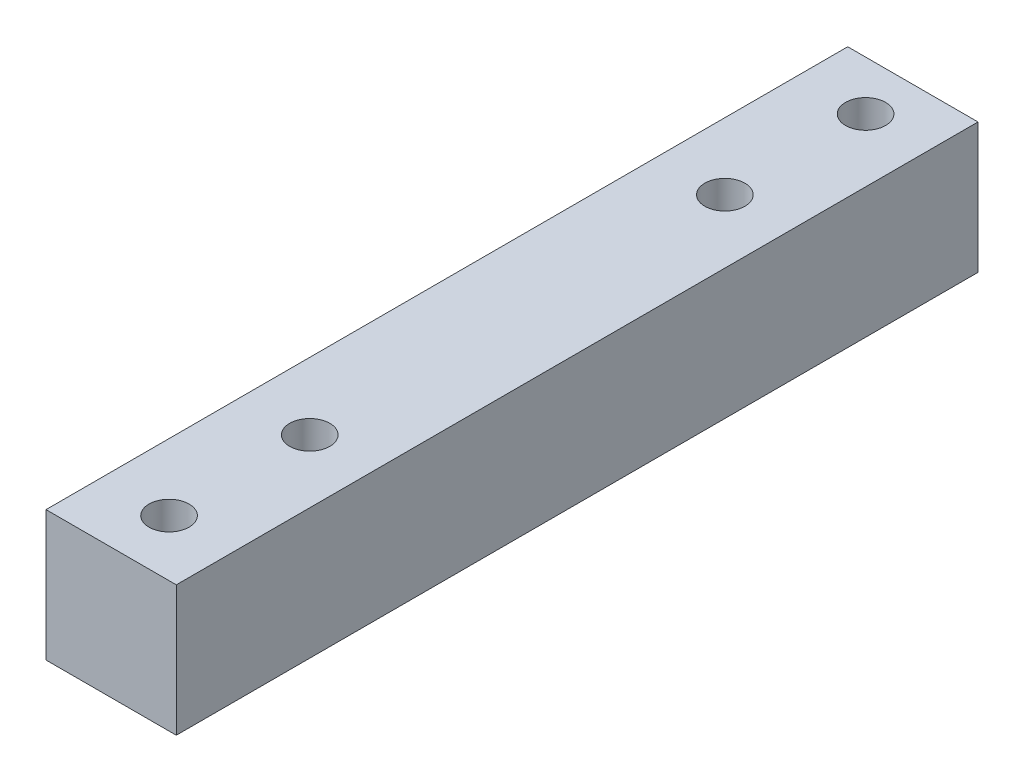
ISO-10303-21;
HEADER;
FILE_DESCRIPTION(('STEP AP214'),'2;1');
FILE_NAME('part.step','',(''),(''),'','','');
FILE_SCHEMA(('AUTOMOTIVE_DESIGN { 1 0 10303 214 1 1 1 1 }'));
ENDSEC;
DATA;
#1=APPLICATION_CONTEXT('core data for automotive mechanical design processes');
#2=APPLICATION_PROTOCOL_DEFINITION('international standard','automotive_design',2000,#1);
#3=PRODUCT_CONTEXT('',#1,'mechanical');
#4=PRODUCT('Part','Part','',(#3));
#5=PRODUCT_RELATED_PRODUCT_CATEGORY('part','',(#4));
#6=PRODUCT_DEFINITION_FORMATION('','',#4);
#7=PRODUCT_DEFINITION_CONTEXT('part definition',#1,'design');
#8=PRODUCT_DEFINITION('design','',#6,#7);
#9=PRODUCT_DEFINITION_SHAPE('','',#8);
#10=(LENGTH_UNIT() NAMED_UNIT(*) SI_UNIT(.MILLI.,.METRE.));
#11=(NAMED_UNIT(*) PLANE_ANGLE_UNIT() SI_UNIT($,.RADIAN.));
#12=(NAMED_UNIT(*) SI_UNIT($,.STERADIAN.) SOLID_ANGLE_UNIT());
#13=UNCERTAINTY_MEASURE_WITH_UNIT(LENGTH_MEASURE(1.E-05),#10,'distance_accuracy_value','');
#14=(GEOMETRIC_REPRESENTATION_CONTEXT(3) GLOBAL_UNCERTAINTY_ASSIGNED_CONTEXT((#13)) GLOBAL_UNIT_ASSIGNED_CONTEXT((#10,
#11,#12)) REPRESENTATION_CONTEXT('',''));
#15=CARTESIAN_POINT('',(0.,0.,0.));
#16=DIRECTION('',(0.,0.,1.));
#17=DIRECTION('',(1.,0.,0.));
#18=AXIS2_PLACEMENT_3D('',#15,#16,#17);
#19=CARTESIAN_POINT('',(6.5,6.80952380952381,80.));
#20=DIRECTION('',(-1.,0.,0.));
#21=DIRECTION('',(0.,-1.,0.));
#22=AXIS2_PLACEMENT_3D('',#19,#20,#21);
#23=PLANE('',#22);
#24=DIRECTION('',(0.,1.,0.));
#25=VECTOR('',#24,1.);
#26=CARTESIAN_POINT('',(6.5,6.80952380952381,0.));
#27=LINE('',#26,#25);
#28=CARTESIAN_POINT('',(6.5,-6.19047619047619,0.));
#29=VERTEX_POINT('',#28);
#30=CARTESIAN_POINT('',(6.5,6.80952380952381,0.));
#31=VERTEX_POINT('',#30);
#32=EDGE_CURVE('E110',#29,#31,#27,.T.);
#33=ORIENTED_EDGE('',*,*,#32,.T.);
#34=DIRECTION('',(0.,0.,-1.));
#35=VECTOR('',#34,1.);
#36=CARTESIAN_POINT('',(6.5,6.80952380952381,80.));
#37=LINE('',#36,#35);
#38=CARTESIAN_POINT('',(6.5,6.80952380952381,80.));
#39=VERTEX_POINT('',#38);
#40=EDGE_CURVE('E11',#39,#31,#37,.T.);
#41=ORIENTED_EDGE('',*,*,#40,.F.);
#42=DIRECTION('',(0.,1.,0.));
#43=VECTOR('',#42,1.);
#44=CARTESIAN_POINT('',(6.5,6.80952380952381,80.));
#45=LINE('',#44,#43);
#46=CARTESIAN_POINT('',(6.5,-6.19047619047619,80.));
#47=VERTEX_POINT('',#46);
#48=EDGE_CURVE('E93',#47,#39,#45,.T.);
#49=ORIENTED_EDGE('',*,*,#48,.F.);
#50=DIRECTION('',(0.,0.,-1.));
#51=VECTOR('',#50,1.);
#52=CARTESIAN_POINT('',(6.5,-6.19047619047619,80.));
#53=LINE('',#52,#51);
#54=EDGE_CURVE('E106',#47,#29,#53,.T.);
#55=ORIENTED_EDGE('',*,*,#54,.T.);
#56=EDGE_LOOP('',(#33,#41,#49,#55));
#57=FACE_BOUND('',#56,.T.);
#58=ADVANCED_FACE('F39',(#57),#23,.F.);
#59=CARTESIAN_POINT('',(-6.5,6.80952380952381,80.));
#60=DIRECTION('',(0.,-1.,0.));
#61=DIRECTION('',(0.,0.,-1.));
#62=AXIS2_PLACEMENT_3D('',#59,#60,#61);
#63=PLANE('',#62);
#64=CARTESIAN_POINT('',(0.197793720815714,6.80952380952381,4.91688549742749));
#65=DIRECTION('',(0.,1.,0.));
#66=DIRECTION('',(0.,0.,1.));
#67=AXIS2_PLACEMENT_3D('',#64,#65,#66);
#68=CIRCLE('',#67,2.);
#69=CARTESIAN_POINT('',(0.197793720815714,6.80952380952381,6.91688549742749));
#70=VERTEX_POINT('',#69);
#71=EDGE_CURVE('E129',#70,#70,#68,.T.);
#72=ORIENTED_EDGE('',*,*,#71,.F.);
#73=EDGE_LOOP('',(#72));
#74=FACE_BOUND('',#73,.T.);
#75=CARTESIAN_POINT('',(0.157458730872985,6.80952380952381,18.9168854974275));
#76=DIRECTION('',(0.,1.,0.));
#77=DIRECTION('',(0.,0.,1.));
#78=AXIS2_PLACEMENT_3D('',#75,#76,#77);
#79=CIRCLE('',#78,2.);
#80=CARTESIAN_POINT('',(0.157458730872985,6.80952380952381,20.9168854974275));
#81=VERTEX_POINT('',#80);
#82=EDGE_CURVE('E246',#81,#81,#79,.T.);
#83=ORIENTED_EDGE('',*,*,#82,.F.);
#84=EDGE_LOOP('',(#83));
#85=FACE_BOUND('',#84,.T.);
#86=CARTESIAN_POINT('',(0.197793720815714,6.80952380952381,60.3793139694021));
#87=DIRECTION('',(0.,1.,0.));
#88=DIRECTION('',(0.,0.,1.));
#89=AXIS2_PLACEMENT_3D('',#86,#87,#88);
#90=CIRCLE('',#89,2.);
#91=CARTESIAN_POINT('',(0.197793720815714,6.80952380952381,62.3793139694021));
#92=VERTEX_POINT('',#91);
#93=EDGE_CURVE('E238',#92,#92,#90,.T.);
#94=ORIENTED_EDGE('',*,*,#93,.F.);
#95=EDGE_LOOP('',(#94));
#96=FACE_BOUND('',#95,.T.);
#97=CARTESIAN_POINT('',(0.157458730872985,6.80952380952381,74.3793139694021));
#98=DIRECTION('',(0.,1.,0.));
#99=DIRECTION('',(0.,0.,1.));
#100=AXIS2_PLACEMENT_3D('',#97,#98,#99);
#101=CIRCLE('',#100,2.);
#102=CARTESIAN_POINT('',(0.157458730872985,6.80952380952381,76.3793139694021));
#103=VERTEX_POINT('',#102);
#104=EDGE_CURVE('E247',#103,#103,#101,.T.);
#105=ORIENTED_EDGE('',*,*,#104,.F.);
#106=EDGE_LOOP('',(#105));
#107=FACE_BOUND('',#106,.T.);
#108=DIRECTION('',(-1.,0.,0.));
#109=VECTOR('',#108,1.);
#110=CARTESIAN_POINT('',(-6.5,6.80952380952381,0.));
#111=LINE('',#110,#109);
#112=CARTESIAN_POINT('',(-6.5,6.80952380952381,0.));
#113=VERTEX_POINT('',#112);
#114=EDGE_CURVE('E98',#31,#113,#111,.T.);
#115=ORIENTED_EDGE('',*,*,#114,.T.);
#116=DIRECTION('',(0.,0.,-1.));
#117=VECTOR('',#116,1.);
#118=CARTESIAN_POINT('',(-6.5,6.80952380952381,80.));
#119=LINE('',#118,#117);
#120=CARTESIAN_POINT('',(-6.5,6.80952380952381,80.));
#121=VERTEX_POINT('',#120);
#122=EDGE_CURVE('E49',#121,#113,#119,.T.);
#123=ORIENTED_EDGE('',*,*,#122,.F.);
#124=DIRECTION('',(-1.,0.,0.));
#125=VECTOR('',#124,1.);
#126=CARTESIAN_POINT('',(-6.5,6.80952380952381,80.));
#127=LINE('',#126,#125);
#128=EDGE_CURVE('E88',#39,#121,#127,.T.);
#129=ORIENTED_EDGE('',*,*,#128,.F.);
#130=ORIENTED_EDGE('',*,*,#40,.T.);
#131=EDGE_LOOP('',(#115,#123,#129,#130));
#132=FACE_BOUND('',#131,.T.);
#133=ADVANCED_FACE('F97',(#74,#85,#96,#107,#132),#63,.F.);
#134=CARTESIAN_POINT('',(-6.5,6.80952380952381,80.));
#135=DIRECTION('',(1.,0.,0.));
#136=DIRECTION('',(0.,0.,-1.));
#137=AXIS2_PLACEMENT_3D('',#134,#135,#136);
#138=PLANE('',#137);
#139=DIRECTION('',(0.,-1.,0.));
#140=VECTOR('',#139,1.);
#141=CARTESIAN_POINT('',(-6.5,6.80952380952381,0.));
#142=LINE('',#141,#140);
#143=CARTESIAN_POINT('',(-6.5,-6.19047619047619,0.));
#144=VERTEX_POINT('',#143);
#145=EDGE_CURVE('E75',#113,#144,#142,.T.);
#146=ORIENTED_EDGE('',*,*,#145,.T.);
#147=DIRECTION('',(0.,0.,-1.));
#148=VECTOR('',#147,1.);
#149=CARTESIAN_POINT('',(-6.5,-6.19047619047619,80.));
#150=LINE('',#149,#148);
#151=CARTESIAN_POINT('',(-6.5,-6.19047619047619,80.));
#152=VERTEX_POINT('',#151);
#153=EDGE_CURVE('E100',#152,#144,#150,.T.);
#154=ORIENTED_EDGE('',*,*,#153,.F.);
#155=DIRECTION('',(0.,-1.,0.));
#156=VECTOR('',#155,1.);
#157=CARTESIAN_POINT('',(-6.5,6.80952380952381,80.));
#158=LINE('',#157,#156);
#159=EDGE_CURVE('E91',#121,#152,#158,.T.);
#160=ORIENTED_EDGE('',*,*,#159,.F.);
#161=ORIENTED_EDGE('',*,*,#122,.T.);
#162=EDGE_LOOP('',(#146,#154,#160,#161));
#163=FACE_BOUND('',#162,.T.);
#164=ADVANCED_FACE('F102',(#163),#138,.F.);
#165=CARTESIAN_POINT('',(-6.5,-6.19047619047619,80.));
#166=DIRECTION('',(0.,1.,0.));
#167=DIRECTION('',(-1.,0.,0.));
#168=AXIS2_PLACEMENT_3D('',#165,#166,#167);
#169=PLANE('',#168);
#170=CARTESIAN_POINT('',(0.197793720815714,-6.19047619047619,4.91688549742749));
#171=DIRECTION('',(0.,1.,0.));
#172=DIRECTION('',(-1.,0.,0.));
#173=AXIS2_PLACEMENT_3D('',#170,#171,#172);
#174=CIRCLE('',#173,2.);
#175=CARTESIAN_POINT('',(-1.80220627918429,-6.19047619047619,4.91688549742749));
#176=VERTEX_POINT('',#175);
#177=EDGE_CURVE('E42',#176,#176,#174,.T.);
#178=ORIENTED_EDGE('',*,*,#177,.T.);
#179=EDGE_LOOP('',(#178));
#180=FACE_BOUND('',#179,.T.);
#181=CARTESIAN_POINT('',(0.157458730872985,-6.19047619047619,18.9168854974275));
#182=DIRECTION('',(0.,1.,0.));
#183=DIRECTION('',(-1.,0.,0.));
#184=AXIS2_PLACEMENT_3D('',#181,#182,#183);
#185=CIRCLE('',#184,2.);
#186=CARTESIAN_POINT('',(-1.84254126912702,-6.19047619047619,18.9168854974275));
#187=VERTEX_POINT('',#186);
#188=EDGE_CURVE('E132',#187,#187,#185,.T.);
#189=ORIENTED_EDGE('',*,*,#188,.T.);
#190=EDGE_LOOP('',(#189));
#191=FACE_BOUND('',#190,.T.);
#192=CARTESIAN_POINT('',(0.197793720815714,-6.19047619047619,60.3793139694021));
#193=DIRECTION('',(0.,1.,0.));
#194=DIRECTION('',(-1.,0.,0.));
#195=AXIS2_PLACEMENT_3D('',#192,#193,#194);
#196=CIRCLE('',#195,2.);
#197=CARTESIAN_POINT('',(-1.80220627918429,-6.19047619047619,60.3793139694021));
#198=VERTEX_POINT('',#197);
#199=EDGE_CURVE('E128',#198,#198,#196,.T.);
#200=ORIENTED_EDGE('',*,*,#199,.T.);
#201=EDGE_LOOP('',(#200));
#202=FACE_BOUND('',#201,.T.);
#203=CARTESIAN_POINT('',(0.157458730872985,-6.19047619047619,74.3793139694021));
#204=DIRECTION('',(0.,1.,0.));
#205=DIRECTION('',(-1.,0.,0.));
#206=AXIS2_PLACEMENT_3D('',#203,#204,#205);
#207=CIRCLE('',#206,2.);
#208=CARTESIAN_POINT('',(-1.84254126912702,-6.19047619047619,74.3793139694021));
#209=VERTEX_POINT('',#208);
#210=EDGE_CURVE('E124',#209,#209,#207,.T.);
#211=ORIENTED_EDGE('',*,*,#210,.T.);
#212=EDGE_LOOP('',(#211));
#213=FACE_BOUND('',#212,.T.);
#214=DIRECTION('',(1.,0.,0.));
#215=VECTOR('',#214,1.);
#216=CARTESIAN_POINT('',(-6.5,-6.19047619047619,0.));
#217=LINE('',#216,#215);
#218=EDGE_CURVE('E81',#144,#29,#217,.T.);
#219=ORIENTED_EDGE('',*,*,#218,.T.);
#220=ORIENTED_EDGE('',*,*,#54,.F.);
#221=DIRECTION('',(1.,0.,0.));
#222=VECTOR('',#221,1.);
#223=CARTESIAN_POINT('',(-6.5,-6.19047619047619,80.));
#224=LINE('',#223,#222);
#225=EDGE_CURVE('E58',#152,#47,#224,.T.);
#226=ORIENTED_EDGE('',*,*,#225,.F.);
#227=ORIENTED_EDGE('',*,*,#153,.T.);
#228=EDGE_LOOP('',(#219,#220,#226,#227));
#229=FACE_BOUND('',#228,.T.);
#230=ADVANCED_FACE('F141',(#180,#191,#202,#213,#229),#169,.F.);
#231=CARTESIAN_POINT('',(0.,0.,80.));
#232=DIRECTION('',(0.,0.,1.));
#233=DIRECTION('',(1.,0.,0.));
#234=AXIS2_PLACEMENT_3D('',#231,#232,#233);
#235=PLANE('',#234);
#236=ORIENTED_EDGE('',*,*,#48,.T.);
#237=ORIENTED_EDGE('',*,*,#128,.T.);
#238=ORIENTED_EDGE('',*,*,#159,.T.);
#239=ORIENTED_EDGE('',*,*,#225,.T.);
#240=EDGE_LOOP('',(#236,#237,#238,#239));
#241=FACE_BOUND('',#240,.T.);
#242=ADVANCED_FACE('F89',(#241),#235,.T.);
#243=CARTESIAN_POINT('',(0.,0.,0.));
#244=DIRECTION('',(0.,0.,1.));
#245=DIRECTION('',(1.,0.,0.));
#246=AXIS2_PLACEMENT_3D('',#243,#244,#245);
#247=PLANE('',#246);
#248=ORIENTED_EDGE('',*,*,#32,.F.);
#249=ORIENTED_EDGE('',*,*,#218,.F.);
#250=ORIENTED_EDGE('',*,*,#145,.F.);
#251=ORIENTED_EDGE('',*,*,#114,.F.);
#252=EDGE_LOOP('',(#248,#249,#250,#251));
#253=FACE_BOUND('',#252,.T.);
#254=ADVANCED_FACE('F163',(#253),#247,.F.);
#255=CARTESIAN_POINT('',(0.157458730872985,-73.1904761904762,74.3793139694021));
#256=DIRECTION('',(0.,1.,0.));
#257=DIRECTION('',(0.,0.,1.));
#258=AXIS2_PLACEMENT_3D('',#255,#256,#257);
#259=CYLINDRICAL_SURFACE('',#258,2.);
#260=ORIENTED_EDGE('',*,*,#104,.T.);
#261=EDGE_LOOP('',(#260));
#262=FACE_BOUND('',#261,.T.);
#263=ORIENTED_EDGE('',*,*,#210,.F.);
#264=EDGE_LOOP('',(#263));
#265=FACE_BOUND('',#264,.T.);
#266=ADVANCED_FACE('F165',(#262,#265),#259,.F.);
#267=CARTESIAN_POINT('',(0.197793720815714,-73.1904761904762,60.3793139694021));
#268=DIRECTION('',(0.,1.,0.));
#269=DIRECTION('',(0.,0.,1.));
#270=AXIS2_PLACEMENT_3D('',#267,#268,#269);
#271=CYLINDRICAL_SURFACE('',#270,2.);
#272=ORIENTED_EDGE('',*,*,#93,.T.);
#273=EDGE_LOOP('',(#272));
#274=FACE_BOUND('',#273,.T.);
#275=ORIENTED_EDGE('',*,*,#199,.F.);
#276=EDGE_LOOP('',(#275));
#277=FACE_BOUND('',#276,.T.);
#278=ADVANCED_FACE('F151',(#274,#277),#271,.F.);
#279=CARTESIAN_POINT('',(0.157458730872985,-73.1904761904762,18.9168854974275));
#280=DIRECTION('',(0.,1.,0.));
#281=DIRECTION('',(0.,0.,1.));
#282=AXIS2_PLACEMENT_3D('',#279,#280,#281);
#283=CYLINDRICAL_SURFACE('',#282,2.);
#284=ORIENTED_EDGE('',*,*,#82,.T.);
#285=EDGE_LOOP('',(#284));
#286=FACE_BOUND('',#285,.T.);
#287=ORIENTED_EDGE('',*,*,#188,.F.);
#288=EDGE_LOOP('',(#287));
#289=FACE_BOUND('',#288,.T.);
#290=ADVANCED_FACE('F145',(#286,#289),#283,.F.);
#291=CARTESIAN_POINT('',(0.197793720815714,-73.1904761904762,4.91688549742749));
#292=DIRECTION('',(0.,1.,0.));
#293=DIRECTION('',(0.,0.,1.));
#294=AXIS2_PLACEMENT_3D('',#291,#292,#293);
#295=CYLINDRICAL_SURFACE('',#294,2.);
#296=ORIENTED_EDGE('',*,*,#71,.T.);
#297=EDGE_LOOP('',(#296));
#298=FACE_BOUND('',#297,.T.);
#299=ORIENTED_EDGE('',*,*,#177,.F.);
#300=EDGE_LOOP('',(#299));
#301=FACE_BOUND('',#300,.T.);
#302=ADVANCED_FACE('F143',(#298,#301),#295,.F.);
#303=CLOSED_SHELL('',(#58,#133,#164,#230,#242,#254,#266,#278,#290,#302));
#304=MANIFOLD_SOLID_BREP('B2',#303);
#305=ADVANCED_BREP_SHAPE_REPRESENTATION('',(#18,#304),#14);
#306=SHAPE_DEFINITION_REPRESENTATION(#9,#305);
ENDSEC;
END-ISO-10303-21;
